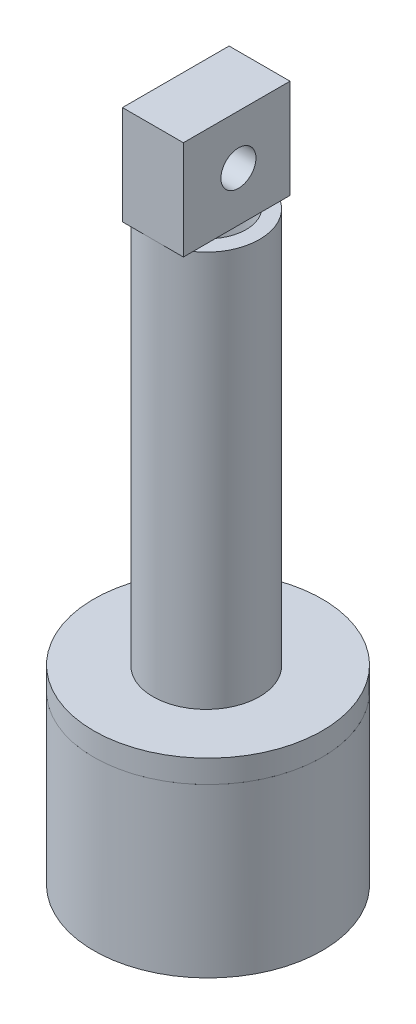
ISO-10303-21;
HEADER;
FILE_DESCRIPTION(('STEP AP214'),'2;1');
FILE_NAME('part.step','',(''),(''),'','','');
FILE_SCHEMA(('AUTOMOTIVE_DESIGN { 1 0 10303 214 1 1 1 1 }'));
ENDSEC;
DATA;
#1=APPLICATION_CONTEXT('core data for automotive mechanical design processes');
#2=APPLICATION_PROTOCOL_DEFINITION('international standard','automotive_design',2000,#1);
#3=PRODUCT_CONTEXT('',#1,'mechanical');
#4=PRODUCT('Part','Part','',(#3));
#5=PRODUCT_RELATED_PRODUCT_CATEGORY('part','',(#4));
#6=PRODUCT_DEFINITION_FORMATION('','',#4);
#7=PRODUCT_DEFINITION_CONTEXT('part definition',#1,'design');
#8=PRODUCT_DEFINITION('design','',#6,#7);
#9=PRODUCT_DEFINITION_SHAPE('','',#8);
#10=(LENGTH_UNIT() NAMED_UNIT(*) SI_UNIT(.MILLI.,.METRE.));
#11=(NAMED_UNIT(*) PLANE_ANGLE_UNIT() SI_UNIT($,.RADIAN.));
#12=(NAMED_UNIT(*) SI_UNIT($,.STERADIAN.) SOLID_ANGLE_UNIT());
#13=UNCERTAINTY_MEASURE_WITH_UNIT(LENGTH_MEASURE(1.E-05),#10,'distance_accuracy_value','');
#14=(GEOMETRIC_REPRESENTATION_CONTEXT(3) GLOBAL_UNCERTAINTY_ASSIGNED_CONTEXT((#13)) GLOBAL_UNIT_ASSIGNED_CONTEXT((#10,
#11,#12)) REPRESENTATION_CONTEXT('',''));
#15=CARTESIAN_POINT('',(0.,0.,0.));
#16=DIRECTION('',(0.,0.,1.));
#17=DIRECTION('',(1.,0.,0.));
#18=AXIS2_PLACEMENT_3D('',#15,#16,#17);
#19=CARTESIAN_POINT('',(0.,75.,0.));
#20=DIRECTION('',(0.,-1.,0.));
#21=DIRECTION('',(0.,0.,-1.));
#22=AXIS2_PLACEMENT_3D('',#19,#20,#21);
#23=PLANE('',#22);
#24=DIRECTION('',(0.,0.,-1.));
#25=VECTOR('',#24,1.);
#26=CARTESIAN_POINT('',(4.,75.,0.));
#27=LINE('',#26,#25);
#28=CARTESIAN_POINT('',(4.,75.,-3.));
#29=VERTEX_POINT('',#28);
#30=CARTESIAN_POINT('',(4.,75.,-5.51369418184037));
#31=VERTEX_POINT('',#30);
#32=EDGE_CURVE('E156',#29,#31,#27,.T.);
#33=ORIENTED_EDGE('',*,*,#32,.F.);
#34=CARTESIAN_POINT('',(0.,75.,0.));
#35=DIRECTION('',(0.,1.,0.));
#36=DIRECTION('',(0.,0.,1.));
#37=AXIS2_PLACEMENT_3D('',#34,#35,#36);
#38=CIRCLE('',#37,5.);
#39=CARTESIAN_POINT('',(4.,75.,3.));
#40=VERTEX_POINT('',#39);
#41=EDGE_CURVE('E56',#40,#29,#38,.T.);
#42=ORIENTED_EDGE('',*,*,#41,.F.);
#43=CARTESIAN_POINT('',(4.,75.,5.97543111123569));
#44=VERTEX_POINT('',#43);
#45=EDGE_CURVE('E184',#44,#40,#27,.T.);
#46=ORIENTED_EDGE('',*,*,#45,.F.);
#47=CARTESIAN_POINT('',(0.,75.,0.230868464697664));
#48=DIRECTION('',(0.,-1.,0.));
#49=DIRECTION('',(0.,0.,-1.));
#50=AXIS2_PLACEMENT_3D('',#47,#48,#49);
#51=CIRCLE('',#50,7.);
#52=EDGE_CURVE('E213',#31,#44,#51,.T.);
#53=ORIENTED_EDGE('',*,*,#52,.F.);
#54=EDGE_LOOP('',(#33,#42,#46,#53));
#55=FACE_BOUND('',#54,.T.);
#56=ADVANCED_FACE('F41',(#55),#23,.F.);
#57=CARTESIAN_POINT('',(0.,23.,0.));
#58=DIRECTION('',(0.,-1.,0.));
#59=DIRECTION('',(0.,0.,-1.));
#60=AXIS2_PLACEMENT_3D('',#57,#58,#59);
#61=CYLINDRICAL_SURFACE('',#60,15.);
#62=CARTESIAN_POINT('',(0.,23.,0.));
#63=DIRECTION('',(0.,1.,0.));
#64=DIRECTION('',(0.,0.,1.));
#65=AXIS2_PLACEMENT_3D('',#62,#63,#64);
#66=CIRCLE('',#65,15.);
#67=CARTESIAN_POINT('',(0.,23.,15.));
#68=VERTEX_POINT('',#67);
#69=EDGE_CURVE('E148',#68,#68,#66,.T.);
#70=ORIENTED_EDGE('',*,*,#69,.F.);
#71=EDGE_LOOP('',(#70));
#72=FACE_BOUND('',#71,.T.);
#73=CARTESIAN_POINT('',(0.,20.,0.));
#74=DIRECTION('',(0.,1.,0.));
#75=DIRECTION('',(0.,0.,1.));
#76=AXIS2_PLACEMENT_3D('',#73,#74,#75);
#77=CIRCLE('',#76,15.);
#78=CARTESIAN_POINT('',(0.,20.,15.));
#79=VERTEX_POINT('',#78);
#80=EDGE_CURVE('E144',#79,#79,#77,.T.);
#81=ORIENTED_EDGE('',*,*,#80,.T.);
#82=EDGE_LOOP('',(#81));
#83=FACE_BOUND('',#82,.T.);
#84=ADVANCED_FACE('F43',(#72,#83),#61,.T.);
#85=CARTESIAN_POINT('',(0.,23.,0.));
#86=DIRECTION('',(0.,1.,0.));
#87=DIRECTION('',(0.,0.,1.));
#88=AXIS2_PLACEMENT_3D('',#85,#86,#87);
#89=PLANE('',#88);
#90=CARTESIAN_POINT('',(0.,23.,0.230868464697664));
#91=DIRECTION('',(0.,-1.,0.));
#92=DIRECTION('',(0.,0.,-1.));
#93=AXIS2_PLACEMENT_3D('',#90,#91,#92);
#94=CIRCLE('',#93,7.);
#95=CARTESIAN_POINT('',(0.,23.,-6.76913153530234));
#96=VERTEX_POINT('',#95);
#97=EDGE_CURVE('E151',#96,#96,#94,.T.);
#98=ORIENTED_EDGE('',*,*,#97,.T.);
#99=EDGE_LOOP('',(#98));
#100=FACE_BOUND('',#99,.T.);
#101=ORIENTED_EDGE('',*,*,#69,.T.);
#102=EDGE_LOOP('',(#101));
#103=FACE_BOUND('',#102,.T.);
#104=ADVANCED_FACE('F217',(#100,#103),#89,.T.);
#105=CARTESIAN_POINT('',(0.,20.,0.));
#106=DIRECTION('',(0.,1.,0.));
#107=DIRECTION('',(0.,0.,1.));
#108=AXIS2_PLACEMENT_3D('',#105,#106,#107);
#109=PLANE('',#108);
#110=ORIENTED_EDGE('',*,*,#80,.F.);
#111=EDGE_LOOP('',(#110));
#112=FACE_BOUND('',#111,.T.);
#113=ADVANCED_FACE('F223',(#112),#109,.F.);
#114=CARTESIAN_POINT('',(0.,73.,0.230868464697664));
#115=DIRECTION('',(0.,-1.,0.));
#116=DIRECTION('',(0.,0.,-1.));
#117=AXIS2_PLACEMENT_3D('',#114,#115,#116);
#118=CYLINDRICAL_SURFACE('',#117,7.);
#119=CARTESIAN_POINT('',(0.,75.,-6.76913153530234));
#120=VERTEX_POINT('',#119);
#121=EDGE_CURVE('E211',#120,#31,#51,.T.);
#122=ORIENTED_EDGE('',*,*,#121,.T.);
#123=ORIENTED_EDGE('',*,*,#52,.T.);
#124=CARTESIAN_POINT('',(0.,75.,7.23086846469767));
#125=VERTEX_POINT('',#124);
#126=EDGE_CURVE('E454',#44,#125,#51,.T.);
#127=ORIENTED_EDGE('',*,*,#126,.T.);
#128=CARTESIAN_POINT('',(-4.,75.,5.97543111123569));
#129=VERTEX_POINT('',#128);
#130=EDGE_CURVE('E450',#125,#129,#51,.T.);
#131=ORIENTED_EDGE('',*,*,#130,.T.);
#132=CARTESIAN_POINT('',(-4.,75.,-5.51369418184037));
#133=VERTEX_POINT('',#132);
#134=EDGE_CURVE('E444',#129,#133,#51,.T.);
#135=ORIENTED_EDGE('',*,*,#134,.T.);
#136=EDGE_CURVE('E210',#133,#120,#51,.T.);
#137=ORIENTED_EDGE('',*,*,#136,.T.);
#138=EDGE_LOOP('',(#122,#123,#127,#131,#135,#137));
#139=FACE_BOUND('',#138,.T.);
#140=ORIENTED_EDGE('',*,*,#97,.F.);
#141=EDGE_LOOP('',(#140));
#142=FACE_BOUND('',#141,.T.);
#143=ADVANCED_FACE('F220',(#139,#142),#118,.T.);
#144=DIRECTION('',(0.,0.,-1.));
#145=VECTOR('',#144,1.);
#146=CARTESIAN_POINT('',(-4.,75.,0.));
#147=LINE('',#146,#145);
#148=CARTESIAN_POINT('',(-4.,75.,3.));
#149=VERTEX_POINT('',#148);
#150=EDGE_CURVE('E131',#129,#149,#147,.T.);
#151=ORIENTED_EDGE('',*,*,#150,.T.);
#152=CARTESIAN_POINT('',(-4.,75.,-3.));
#153=VERTEX_POINT('',#152);
#154=EDGE_CURVE('E61',#153,#149,#38,.T.);
#155=ORIENTED_EDGE('',*,*,#154,.F.);
#156=EDGE_CURVE('E194',#153,#133,#147,.T.);
#157=ORIENTED_EDGE('',*,*,#156,.T.);
#158=ORIENTED_EDGE('',*,*,#134,.F.);
#159=EDGE_LOOP('',(#151,#155,#157,#158));
#160=FACE_BOUND('',#159,.T.);
#161=ADVANCED_FACE('F222',(#160),#23,.F.);
#162=CARTESIAN_POINT('',(4.,75.,0.));
#163=DIRECTION('',(0.,1.,0.));
#164=DIRECTION('',(0.,0.,1.));
#165=AXIS2_PLACEMENT_3D('',#162,#163,#164);
#166=PLANE('',#165);
#167=ORIENTED_EDGE('',*,*,#126,.F.);
#168=CARTESIAN_POINT('',(4.,75.,7.23086846469767));
#169=VERTEX_POINT('',#168);
#170=EDGE_CURVE('E180',#169,#44,#27,.T.);
#171=ORIENTED_EDGE('',*,*,#170,.F.);
#172=DIRECTION('',(-1.,0.,0.));
#173=VECTOR('',#172,1.);
#174=CARTESIAN_POINT('',(4.,75.,7.23086846469767));
#175=LINE('',#174,#173);
#176=EDGE_CURVE('E207',#169,#125,#175,.T.);
#177=ORIENTED_EDGE('',*,*,#176,.T.);
#178=EDGE_LOOP('',(#167,#171,#177));
#179=FACE_BOUND('',#178,.T.);
#180=ADVANCED_FACE('F231',(#179),#166,.F.);
#181=ORIENTED_EDGE('',*,*,#130,.F.);
#182=CARTESIAN_POINT('',(-4.,75.,7.23086846469767));
#183=VERTEX_POINT('',#182);
#184=EDGE_CURVE('E206',#125,#183,#175,.T.);
#185=ORIENTED_EDGE('',*,*,#184,.T.);
#186=EDGE_CURVE('E190',#183,#129,#147,.T.);
#187=ORIENTED_EDGE('',*,*,#186,.T.);
#188=EDGE_LOOP('',(#181,#185,#187));
#189=FACE_BOUND('',#188,.T.);
#190=ADVANCED_FACE('F344',(#189),#166,.F.);
#191=ORIENTED_EDGE('',*,*,#121,.F.);
#192=DIRECTION('',(-1.,0.,0.));
#193=VECTOR('',#192,1.);
#194=CARTESIAN_POINT('',(4.,75.,-6.76913153530234));
#195=LINE('',#194,#193);
#196=CARTESIAN_POINT('',(4.,75.,-6.76913153530234));
#197=VERTEX_POINT('',#196);
#198=EDGE_CURVE('E203',#197,#120,#195,.T.);
#199=ORIENTED_EDGE('',*,*,#198,.F.);
#200=EDGE_CURVE('E178',#31,#197,#27,.T.);
#201=ORIENTED_EDGE('',*,*,#200,.F.);
#202=EDGE_LOOP('',(#191,#199,#201));
#203=FACE_BOUND('',#202,.T.);
#204=ADVANCED_FACE('F249',(#203),#166,.F.);
#205=CARTESIAN_POINT('',(4.,0.,7.23086846469767));
#206=DIRECTION('',(0.,0.,1.));
#207=DIRECTION('',(0.,-1.,0.));
#208=AXIS2_PLACEMENT_3D('',#205,#206,#207);
#209=PLANE('',#208);
#210=DIRECTION('',(0.,1.,0.));
#211=VECTOR('',#210,1.);
#212=CARTESIAN_POINT('',(-4.,0.,7.23086846469767));
#213=LINE('',#212,#211);
#214=CARTESIAN_POINT('',(-4.,88.,7.23086846469766));
#215=VERTEX_POINT('',#214);
#216=EDGE_CURVE('E160',#183,#215,#213,.T.);
#217=ORIENTED_EDGE('',*,*,#216,.F.);
#218=ORIENTED_EDGE('',*,*,#184,.F.);
#219=ORIENTED_EDGE('',*,*,#176,.F.);
#220=DIRECTION('',(0.,1.,0.));
#221=VECTOR('',#220,1.);
#222=CARTESIAN_POINT('',(4.,0.,7.23086846469767));
#223=LINE('',#222,#221);
#224=CARTESIAN_POINT('',(4.,88.,7.23086846469766));
#225=VERTEX_POINT('',#224);
#226=EDGE_CURVE('E175',#169,#225,#223,.T.);
#227=ORIENTED_EDGE('',*,*,#226,.T.);
#228=DIRECTION('',(-1.,0.,0.));
#229=VECTOR('',#228,1.);
#230=CARTESIAN_POINT('',(4.,88.,7.23086846469766));
#231=LINE('',#230,#229);
#232=EDGE_CURVE('E188',#225,#215,#231,.T.);
#233=ORIENTED_EDGE('',*,*,#232,.T.);
#234=EDGE_LOOP('',(#217,#218,#219,#227,#233));
#235=FACE_BOUND('',#234,.T.);
#236=ADVANCED_FACE('F245',(#235),#209,.T.);
#237=ORIENTED_EDGE('',*,*,#136,.F.);
#238=CARTESIAN_POINT('',(-4.,75.,-6.76913153530234));
#239=VERTEX_POINT('',#238);
#240=EDGE_CURVE('E165',#133,#239,#147,.T.);
#241=ORIENTED_EDGE('',*,*,#240,.T.);
#242=EDGE_CURVE('E202',#120,#239,#195,.T.);
#243=ORIENTED_EDGE('',*,*,#242,.F.);
#244=EDGE_LOOP('',(#237,#241,#243));
#245=FACE_BOUND('',#244,.T.);
#246=ADVANCED_FACE('F248',(#245),#166,.F.);
#247=CARTESIAN_POINT('',(4.,0.,-6.76913153530234));
#248=DIRECTION('',(0.,0.,1.));
#249=DIRECTION('',(1.,0.,0.));
#250=AXIS2_PLACEMENT_3D('',#247,#248,#249);
#251=PLANE('',#250);
#252=DIRECTION('',(0.,1.,0.));
#253=VECTOR('',#252,1.);
#254=CARTESIAN_POINT('',(-4.,0.,-6.76913153530234));
#255=LINE('',#254,#253);
#256=CARTESIAN_POINT('',(-4.,88.,-6.76913153530234));
#257=VERTEX_POINT('',#256);
#258=EDGE_CURVE('E193',#239,#257,#255,.T.);
#259=ORIENTED_EDGE('',*,*,#258,.T.);
#260=DIRECTION('',(-1.,0.,0.));
#261=VECTOR('',#260,1.);
#262=CARTESIAN_POINT('',(4.,88.,-6.76913153530234));
#263=LINE('',#262,#261);
#264=CARTESIAN_POINT('',(4.,88.,-6.76913153530234));
#265=VERTEX_POINT('',#264);
#266=EDGE_CURVE('E200',#265,#257,#263,.T.);
#267=ORIENTED_EDGE('',*,*,#266,.F.);
#268=DIRECTION('',(0.,1.,0.));
#269=VECTOR('',#268,1.);
#270=CARTESIAN_POINT('',(4.,0.,-6.76913153530234));
#271=LINE('',#270,#269);
#272=EDGE_CURVE('E183',#197,#265,#271,.T.);
#273=ORIENTED_EDGE('',*,*,#272,.F.);
#274=ORIENTED_EDGE('',*,*,#198,.T.);
#275=ORIENTED_EDGE('',*,*,#242,.T.);
#276=EDGE_LOOP('',(#259,#267,#273,#274,#275));
#277=FACE_BOUND('',#276,.T.);
#278=ADVANCED_FACE('F253',(#277),#251,.F.);
#279=CARTESIAN_POINT('',(4.,88.,0.));
#280=DIRECTION('',(0.,1.,0.));
#281=DIRECTION('',(0.,0.,1.));
#282=AXIS2_PLACEMENT_3D('',#279,#280,#281);
#283=PLANE('',#282);
#284=DIRECTION('',(0.,0.,-1.));
#285=VECTOR('',#284,1.);
#286=CARTESIAN_POINT('',(-4.,88.,0.));
#287=LINE('',#286,#285);
#288=EDGE_CURVE('E179',#215,#257,#287,.T.);
#289=ORIENTED_EDGE('',*,*,#288,.F.);
#290=ORIENTED_EDGE('',*,*,#232,.F.);
#291=DIRECTION('',(0.,0.,-1.));
#292=VECTOR('',#291,1.);
#293=CARTESIAN_POINT('',(4.,88.,0.));
#294=LINE('',#293,#292);
#295=EDGE_CURVE('E186',#225,#265,#294,.T.);
#296=ORIENTED_EDGE('',*,*,#295,.T.);
#297=ORIENTED_EDGE('',*,*,#266,.T.);
#298=EDGE_LOOP('',(#289,#290,#296,#297));
#299=FACE_BOUND('',#298,.T.);
#300=ADVANCED_FACE('F257',(#299),#283,.T.);
#301=CARTESIAN_POINT('',(4.,0.,0.));
#302=DIRECTION('',(1.,0.,0.));
#303=DIRECTION('',(0.,0.,-1.));
#304=AXIS2_PLACEMENT_3D('',#301,#302,#303);
#305=PLANE('',#304);
#306=CARTESIAN_POINT('',(4.,81.5,0.));
#307=DIRECTION('',(1.,0.,0.));
#308=DIRECTION('',(0.,0.,-1.));
#309=AXIS2_PLACEMENT_3D('',#306,#307,#308);
#310=CIRCLE('',#309,2.3);
#311=CARTESIAN_POINT('',(4.,81.5,-2.3));
#312=VERTEX_POINT('',#311);
#313=EDGE_CURVE('E161',#312,#312,#310,.T.);
#314=ORIENTED_EDGE('',*,*,#313,.F.);
#315=EDGE_LOOP('',(#314));
#316=FACE_BOUND('',#315,.T.);
#317=ORIENTED_EDGE('',*,*,#226,.F.);
#318=ORIENTED_EDGE('',*,*,#170,.T.);
#319=ORIENTED_EDGE('',*,*,#45,.T.);
#320=DIRECTION('',(0.,0.,1.));
#321=VECTOR('',#320,1.);
#322=CARTESIAN_POINT('',(4.,75.,0.));
#323=LINE('',#322,#321);
#324=EDGE_CURVE('E168',#29,#40,#323,.T.);
#325=ORIENTED_EDGE('',*,*,#324,.F.);
#326=ORIENTED_EDGE('',*,*,#32,.T.);
#327=ORIENTED_EDGE('',*,*,#200,.T.);
#328=ORIENTED_EDGE('',*,*,#272,.T.);
#329=ORIENTED_EDGE('',*,*,#295,.F.);
#330=EDGE_LOOP('',(#317,#318,#319,#325,#326,#327,#328,#329));
#331=FACE_BOUND('',#330,.T.);
#332=ADVANCED_FACE('F261',(#316,#331),#305,.T.);
#333=CARTESIAN_POINT('',(-4.,0.,0.));
#334=DIRECTION('',(1.,0.,0.));
#335=DIRECTION('',(0.,0.,-1.));
#336=AXIS2_PLACEMENT_3D('',#333,#334,#335);
#337=PLANE('',#336);
#338=CARTESIAN_POINT('',(-4.,81.5,0.));
#339=DIRECTION('',(1.,0.,0.));
#340=DIRECTION('',(0.,0.,-1.));
#341=AXIS2_PLACEMENT_3D('',#338,#339,#340);
#342=CIRCLE('',#341,2.3);
#343=CARTESIAN_POINT('',(-4.,81.5,-2.3));
#344=VERTEX_POINT('',#343);
#345=EDGE_CURVE('E158',#344,#344,#342,.T.);
#346=ORIENTED_EDGE('',*,*,#345,.T.);
#347=EDGE_LOOP('',(#346));
#348=FACE_BOUND('',#347,.T.);
#349=ORIENTED_EDGE('',*,*,#216,.T.);
#350=ORIENTED_EDGE('',*,*,#288,.T.);
#351=ORIENTED_EDGE('',*,*,#258,.F.);
#352=ORIENTED_EDGE('',*,*,#240,.F.);
#353=ORIENTED_EDGE('',*,*,#156,.F.);
#354=EDGE_CURVE('E438',#149,#153,#147,.T.);
#355=ORIENTED_EDGE('',*,*,#354,.F.);
#356=ORIENTED_EDGE('',*,*,#150,.F.);
#357=ORIENTED_EDGE('',*,*,#186,.F.);
#358=EDGE_LOOP('',(#349,#350,#351,#352,#353,#355,#356,#357));
#359=FACE_BOUND('',#358,.T.);
#360=ADVANCED_FACE('F263',(#348,#359),#337,.F.);
#361=CARTESIAN_POINT('',(-6.,81.5,0.));
#362=DIRECTION('',(1.,0.,0.));
#363=DIRECTION('',(0.,0.,-1.));
#364=AXIS2_PLACEMENT_3D('',#361,#362,#363);
#365=CYLINDRICAL_SURFACE('',#364,2.3);
#366=ORIENTED_EDGE('',*,*,#313,.T.);
#367=EDGE_LOOP('',(#366));
#368=FACE_BOUND('',#367,.T.);
#369=ORIENTED_EDGE('',*,*,#345,.F.);
#370=EDGE_LOOP('',(#369));
#371=FACE_BOUND('',#370,.T.);
#372=ADVANCED_FACE('F266',(#368,#371),#365,.F.);
#373=CARTESIAN_POINT('',(0.,75.,0.));
#374=DIRECTION('',(0.,1.,0.));
#375=DIRECTION('',(0.,0.,1.));
#376=AXIS2_PLACEMENT_3D('',#373,#374,#375);
#377=PLANE('',#376);
#378=ORIENTED_EDGE('',*,*,#324,.T.);
#379=EDGE_CURVE('E458',#149,#40,#38,.T.);
#380=ORIENTED_EDGE('',*,*,#379,.F.);
#381=ORIENTED_EDGE('',*,*,#354,.T.);
#382=EDGE_CURVE('E456',#29,#153,#38,.T.);
#383=ORIENTED_EDGE('',*,*,#382,.F.);
#384=EDGE_LOOP('',(#378,#380,#381,#383));
#385=FACE_BOUND('',#384,.T.);
#386=ADVANCED_FACE('F272',(#385),#377,.F.);
#387=CARTESIAN_POINT('',(0.,65.,0.));
#388=DIRECTION('',(0.,1.,0.));
#389=DIRECTION('',(0.,0.,1.));
#390=AXIS2_PLACEMENT_3D('',#387,#388,#389);
#391=CYLINDRICAL_SURFACE('',#390,5.);
#392=DIRECTION('',(0.,1.,0.));
#393=VECTOR('',#392,1.);
#394=CARTESIAN_POINT('',(4.99866731619559,70.,0.115434232348738));
#395=LINE('',#394,#393);
#396=CARTESIAN_POINT('',(4.99866731619559,65.,0.115434232348738));
#397=VERTEX_POINT('',#396);
#398=CARTESIAN_POINT('',(4.99866731619559,73.,0.115434232348813));
#399=VERTEX_POINT('',#398);
#400=EDGE_CURVE('E12',#397,#399,#395,.T.);
#401=ORIENTED_EDGE('',*,*,#400,.T.);
#402=CARTESIAN_POINT('',(0.,73.,0.));
#403=DIRECTION('',(0.,-1.,0.));
#404=DIRECTION('',(0.,0.,-1.));
#405=AXIS2_PLACEMENT_3D('',#402,#403,#404);
#406=CIRCLE('',#405,5.);
#407=CARTESIAN_POINT('',(-4.99866731619559,73.,0.115434232348738));
#408=VERTEX_POINT('',#407);
#409=EDGE_CURVE('E136',#399,#408,#406,.T.);
#410=ORIENTED_EDGE('',*,*,#409,.T.);
#411=DIRECTION('',(0.,1.,0.));
#412=VECTOR('',#411,1.);
#413=CARTESIAN_POINT('',(-4.99866731619559,70.,0.115434232348738));
#414=LINE('',#413,#412);
#415=CARTESIAN_POINT('',(-4.99866731619559,65.,0.115434232348738));
#416=VERTEX_POINT('',#415);
#417=EDGE_CURVE('E49',#408,#416,#414,.F.);
#418=ORIENTED_EDGE('',*,*,#417,.T.);
#419=CARTESIAN_POINT('',(0.,65.,0.));
#420=DIRECTION('',(0.,1.,0.));
#421=DIRECTION('',(0.,0.,1.));
#422=AXIS2_PLACEMENT_3D('',#419,#420,#421);
#423=CIRCLE('',#422,5.);
#424=EDGE_CURVE('E126',#397,#416,#423,.T.);
#425=ORIENTED_EDGE('',*,*,#424,.F.);
#426=EDGE_LOOP('',(#401,#410,#418,#425));
#427=FACE_BOUND('',#426,.T.);
#428=ORIENTED_EDGE('',*,*,#41,.T.);
#429=ORIENTED_EDGE('',*,*,#382,.T.);
#430=ORIENTED_EDGE('',*,*,#154,.T.);
#431=ORIENTED_EDGE('',*,*,#379,.T.);
#432=EDGE_LOOP('',(#428,#429,#430,#431));
#433=FACE_BOUND('',#432,.T.);
#434=ADVANCED_FACE('F134',(#427,#433),#391,.F.);
#435=CARTESIAN_POINT('',(0.,65.,0.));
#436=DIRECTION('',(0.,1.,0.));
#437=DIRECTION('',(0.,0.,1.));
#438=AXIS2_PLACEMENT_3D('',#435,#436,#437);
#439=PLANE('',#438);
#440=ORIENTED_EDGE('',*,*,#424,.T.);
#441=CARTESIAN_POINT('',(0.,65.,0.230868464697664));
#442=DIRECTION('',(0.,1.,0.));
#443=DIRECTION('',(0.,0.,1.));
#444=AXIS2_PLACEMENT_3D('',#441,#442,#443);
#445=CIRCLE('',#444,5.);
#446=EDGE_CURVE('E123',#397,#416,#445,.T.);
#447=ORIENTED_EDGE('',*,*,#446,.F.);
#448=EDGE_LOOP('',(#440,#447));
#449=FACE_BOUND('',#448,.T.);
#450=ADVANCED_FACE('F125',(#449),#439,.T.);
#451=CARTESIAN_POINT('',(0.,73.,0.));
#452=DIRECTION('',(0.,-1.,0.));
#453=DIRECTION('',(0.,0.,-1.));
#454=AXIS2_PLACEMENT_3D('',#451,#452,#453);
#455=PLANE('',#454);
#456=ORIENTED_EDGE('',*,*,#409,.F.);
#457=CARTESIAN_POINT('',(0.,73.,0.230868464697664));
#458=DIRECTION('',(0.,-1.,0.));
#459=DIRECTION('',(0.,0.,-1.));
#460=AXIS2_PLACEMENT_3D('',#457,#458,#459);
#461=CIRCLE('',#460,5.);
#462=EDGE_CURVE('E142',#399,#408,#461,.T.);
#463=ORIENTED_EDGE('',*,*,#462,.T.);
#464=EDGE_LOOP('',(#456,#463));
#465=FACE_BOUND('',#464,.T.);
#466=ADVANCED_FACE('F279',(#465),#455,.T.);
#467=CARTESIAN_POINT('',(0.,73.,0.230868464697664));
#468=DIRECTION('',(0.,-1.,0.));
#469=DIRECTION('',(0.,0.,-1.));
#470=AXIS2_PLACEMENT_3D('',#467,#468,#469);
#471=CYLINDRICAL_SURFACE('',#470,5.);
#472=ORIENTED_EDGE('',*,*,#400,.F.);
#473=ORIENTED_EDGE('',*,*,#446,.T.);
#474=ORIENTED_EDGE('',*,*,#417,.F.);
#475=ORIENTED_EDGE('',*,*,#462,.F.);
#476=EDGE_LOOP('',(#472,#473,#474,#475));
#477=FACE_BOUND('',#476,.T.);
#478=CARTESIAN_POINT('',(0.,25.,0.230868464697664));
#479=DIRECTION('',(0.,-1.,0.));
#480=DIRECTION('',(0.,0.,-1.));
#481=AXIS2_PLACEMENT_3D('',#478,#479,#480);
#482=CIRCLE('',#481,5.00000000000001);
#483=CARTESIAN_POINT('',(0.,25.,-4.76913153530234));
#484=VERTEX_POINT('',#483);
#485=EDGE_CURVE('E145',#484,#484,#482,.T.);
#486=ORIENTED_EDGE('',*,*,#485,.T.);
#487=EDGE_LOOP('',(#486));
#488=FACE_BOUND('',#487,.T.);
#489=ADVANCED_FACE('F139',(#477,#488),#471,.F.);
#490=CARTESIAN_POINT('',(0.,25.,0.));
#491=DIRECTION('',(0.,1.,0.));
#492=DIRECTION('',(0.,0.,1.));
#493=AXIS2_PLACEMENT_3D('',#490,#491,#492);
#494=PLANE('',#493);
#495=ORIENTED_EDGE('',*,*,#485,.F.);
#496=EDGE_LOOP('',(#495));
#497=FACE_BOUND('',#496,.T.);
#498=ADVANCED_FACE('F287',(#497),#494,.T.);
#499=CLOSED_SHELL('',(#56,#84,#104,#113,#143,#161,#180,#190,#204,#236,#246,#278,#300,#332,#360,
#372,#386,#434,#450,#466,#489,#498));
#500=MANIFOLD_SOLID_BREP('B2',#499);
#501=CARTESIAN_POINT('',(0.,20.,0.));
#502=DIRECTION('',(0.,1.,0.));
#503=DIRECTION('',(0.,0.,1.));
#504=AXIS2_PLACEMENT_3D('',#501,#502,#503);
#505=PLANE('',#504);
#506=CARTESIAN_POINT('',(0.,20.,0.));
#507=DIRECTION('',(0.,1.,0.));
#508=DIRECTION('',(0.,0.,1.));
#509=AXIS2_PLACEMENT_3D('',#506,#507,#508);
#510=CIRCLE('',#509,15.);
#511=CARTESIAN_POINT('',(0.,20.,15.));
#512=VERTEX_POINT('',#511);
#513=EDGE_CURVE('E40',#512,#512,#510,.T.);
#514=ORIENTED_EDGE('',*,*,#513,.T.);
#515=EDGE_LOOP('',(#514));
#516=FACE_BOUND('',#515,.T.);
#517=CARTESIAN_POINT('',(0.,20.,0.));
#518=DIRECTION('',(0.,1.,0.));
#519=DIRECTION('',(0.,0.,1.));
#520=AXIS2_PLACEMENT_3D('',#517,#518,#519);
#521=CIRCLE('',#520,12.5);
#522=CARTESIAN_POINT('',(0.,20.,12.5));
#523=VERTEX_POINT('',#522);
#524=EDGE_CURVE('E474',#523,#523,#521,.T.);
#525=ORIENTED_EDGE('',*,*,#524,.F.);
#526=EDGE_LOOP('',(#525));
#527=FACE_BOUND('',#526,.T.);
#528=ADVANCED_FACE('F467',(#516,#527),#505,.T.);
#529=CARTESIAN_POINT('',(0.,20.,0.));
#530=DIRECTION('',(0.,-1.,0.));
#531=DIRECTION('',(0.,0.,-1.));
#532=AXIS2_PLACEMENT_3D('',#529,#530,#531);
#533=CYLINDRICAL_SURFACE('',#532,15.);
#534=ORIENTED_EDGE('',*,*,#513,.F.);
#535=EDGE_LOOP('',(#534));
#536=FACE_BOUND('',#535,.T.);
#537=CARTESIAN_POINT('',(0.,-2.,0.));
#538=DIRECTION('',(0.,-1.,0.));
#539=DIRECTION('',(0.,0.,-1.));
#540=AXIS2_PLACEMENT_3D('',#537,#538,#539);
#541=CIRCLE('',#540,15.);
#542=CARTESIAN_POINT('',(0.,-2.,-15.));
#543=VERTEX_POINT('',#542);
#544=EDGE_CURVE('E488',#543,#543,#541,.T.);
#545=ORIENTED_EDGE('',*,*,#544,.F.);
#546=EDGE_LOOP('',(#545));
#547=FACE_BOUND('',#546,.T.);
#548=ADVANCED_FACE('F469',(#536,#547),#533,.T.);
#549=CARTESIAN_POINT('',(0.,20.,0.));
#550=DIRECTION('',(0.,-1.,0.));
#551=DIRECTION('',(0.,0.,-1.));
#552=AXIS2_PLACEMENT_3D('',#549,#550,#551);
#553=CYLINDRICAL_SURFACE('',#552,12.5);
#554=ORIENTED_EDGE('',*,*,#524,.T.);
#555=EDGE_LOOP('',(#554));
#556=FACE_BOUND('',#555,.T.);
#557=CARTESIAN_POINT('',(0.,0.,0.));
#558=DIRECTION('',(0.,1.,0.));
#559=DIRECTION('',(0.,0.,1.));
#560=AXIS2_PLACEMENT_3D('',#557,#558,#559);
#561=CIRCLE('',#560,12.5);
#562=CARTESIAN_POINT('',(0.,0.,12.5));
#563=VERTEX_POINT('',#562);
#564=EDGE_CURVE('E478',#563,#563,#561,.T.);
#565=ORIENTED_EDGE('',*,*,#564,.F.);
#566=EDGE_LOOP('',(#565));
#567=FACE_BOUND('',#566,.T.);
#568=ADVANCED_FACE('F498',(#556,#567),#553,.F.);
#569=CARTESIAN_POINT('',(0.,0.,0.));
#570=DIRECTION('',(0.,-1.,0.));
#571=DIRECTION('',(0.,0.,-1.));
#572=AXIS2_PLACEMENT_3D('',#569,#570,#571);
#573=PLANE('',#572);
#574=CARTESIAN_POINT('',(0.,0.,0.));
#575=DIRECTION('',(0.,-1.,0.));
#576=DIRECTION('',(0.,0.,-1.));
#577=AXIS2_PLACEMENT_3D('',#574,#575,#576);
#578=CIRCLE('',#577,11.);
#579=CARTESIAN_POINT('',(0.,0.,-11.));
#580=VERTEX_POINT('',#579);
#581=EDGE_CURVE('E485',#580,#580,#578,.T.);
#582=ORIENTED_EDGE('',*,*,#581,.T.);
#583=EDGE_LOOP('',(#582));
#584=FACE_BOUND('',#583,.T.);
#585=ORIENTED_EDGE('',*,*,#564,.T.);
#586=EDGE_LOOP('',(#585));
#587=FACE_BOUND('',#586,.T.);
#588=ADVANCED_FACE('F504',(#584,#587),#573,.F.);
#589=CARTESIAN_POINT('',(0.,-2.,0.));
#590=DIRECTION('',(0.,1.,0.));
#591=DIRECTION('',(0.,0.,1.));
#592=AXIS2_PLACEMENT_3D('',#589,#590,#591);
#593=CYLINDRICAL_SURFACE('',#592,11.);
#594=CARTESIAN_POINT('',(0.,-2.,0.));
#595=DIRECTION('',(0.,-1.,0.));
#596=DIRECTION('',(0.,0.,-1.));
#597=AXIS2_PLACEMENT_3D('',#594,#595,#596);
#598=CIRCLE('',#597,11.);
#599=CARTESIAN_POINT('',(0.,-2.,-11.));
#600=VERTEX_POINT('',#599);
#601=EDGE_CURVE('E483',#600,#600,#598,.T.);
#602=ORIENTED_EDGE('',*,*,#601,.T.);
#603=EDGE_LOOP('',(#602));
#604=FACE_BOUND('',#603,.T.);
#605=ORIENTED_EDGE('',*,*,#581,.F.);
#606=EDGE_LOOP('',(#605));
#607=FACE_BOUND('',#606,.T.);
#608=ADVANCED_FACE('F510',(#604,#607),#593,.F.);
#609=CARTESIAN_POINT('',(0.,-2.,0.));
#610=DIRECTION('',(0.,-1.,0.));
#611=DIRECTION('',(0.,0.,-1.));
#612=AXIS2_PLACEMENT_3D('',#609,#610,#611);
#613=PLANE('',#612);
#614=ORIENTED_EDGE('',*,*,#544,.T.);
#615=EDGE_LOOP('',(#614));
#616=FACE_BOUND('',#615,.T.);
#617=ORIENTED_EDGE('',*,*,#601,.F.);
#618=EDGE_LOOP('',(#617));
#619=FACE_BOUND('',#618,.T.);
#620=ADVANCED_FACE('F494',(#616,#619),#613,.T.);
#621=CLOSED_SHELL('',(#528,#548,#568,#588,#608,#620));
#622=MANIFOLD_SOLID_BREP('B6',#621);
#623=ADVANCED_BREP_SHAPE_REPRESENTATION('',(#18,#500,#622),#14);
#624=SHAPE_DEFINITION_REPRESENTATION(#9,#623);
ENDSEC;
END-ISO-10303-21;
